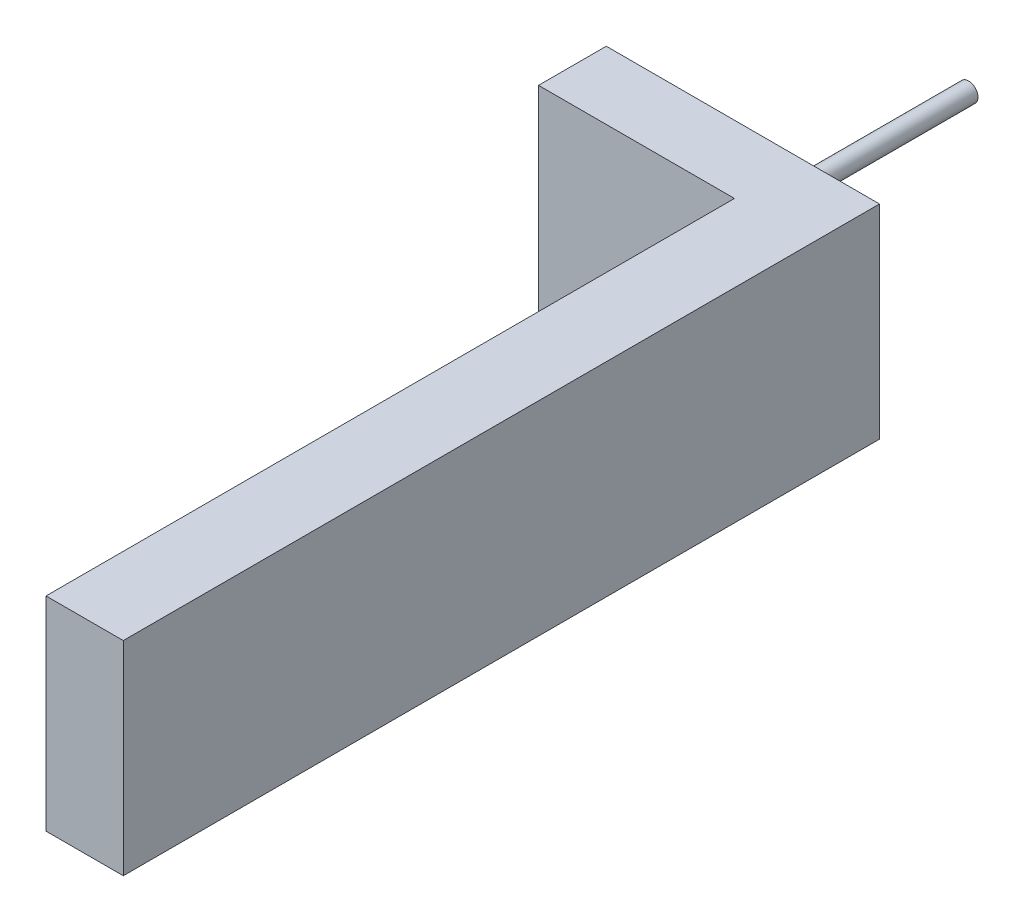
ISO-10303-21;
HEADER;
FILE_DESCRIPTION(('STEP AP214'),'2;1');
FILE_NAME('part.step','',(''),(''),'','','');
FILE_SCHEMA(('AUTOMOTIVE_DESIGN { 1 0 10303 214 1 1 1 1 }'));
ENDSEC;
DATA;
#1=APPLICATION_CONTEXT('core data for automotive mechanical design processes');
#2=APPLICATION_PROTOCOL_DEFINITION('international standard','automotive_design',2000,#1);
#3=PRODUCT_CONTEXT('',#1,'mechanical');
#4=PRODUCT('Part','Part','',(#3));
#5=PRODUCT_RELATED_PRODUCT_CATEGORY('part','',(#4));
#6=PRODUCT_DEFINITION_FORMATION('','',#4);
#7=PRODUCT_DEFINITION_CONTEXT('part definition',#1,'design');
#8=PRODUCT_DEFINITION('design','',#6,#7);
#9=PRODUCT_DEFINITION_SHAPE('','',#8);
#10=(LENGTH_UNIT() NAMED_UNIT(*) SI_UNIT(.MILLI.,.METRE.));
#11=(NAMED_UNIT(*) PLANE_ANGLE_UNIT() SI_UNIT($,.RADIAN.));
#12=(NAMED_UNIT(*) SI_UNIT($,.STERADIAN.) SOLID_ANGLE_UNIT());
#13=UNCERTAINTY_MEASURE_WITH_UNIT(LENGTH_MEASURE(1.E-05),#10,'distance_accuracy_value','');
#14=(GEOMETRIC_REPRESENTATION_CONTEXT(3) GLOBAL_UNCERTAINTY_ASSIGNED_CONTEXT((#13)) GLOBAL_UNIT_ASSIGNED_CONTEXT((#10,
#11,#12)) REPRESENTATION_CONTEXT('',''));
#15=CARTESIAN_POINT('',(0.,0.,0.));
#16=DIRECTION('',(0.,0.,1.));
#17=DIRECTION('',(1.,0.,0.));
#18=AXIS2_PLACEMENT_3D('',#15,#16,#17);
#19=CARTESIAN_POINT('',(0.,0.,353.06));
#20=DIRECTION('',(0.,0.,-1.));
#21=DIRECTION('',(-1.,0.,0.));
#22=AXIS2_PLACEMENT_3D('',#19,#20,#21);
#23=CYLINDRICAL_SURFACE('',#22,13.9);
#24=CARTESIAN_POINT('',(0.,0.,353.06));
#25=DIRECTION('',(0.,0.,1.));
#26=DIRECTION('',(1.,0.,0.));
#27=AXIS2_PLACEMENT_3D('',#24,#25,#26);
#28=CIRCLE('',#27,13.9);
#29=CARTESIAN_POINT('',(-13.9,0.,353.06));
#30=VERTEX_POINT('',#29);
#31=EDGE_CURVE('E11',#30,#30,#28,.T.);
#32=CARTESIAN_POINT('',(0.,0.,0.));
#33=DIRECTION('',(0.,0.,1.));
#34=DIRECTION('',(1.,0.,0.));
#35=AXIS2_PLACEMENT_3D('',#32,#33,#34);
#36=CIRCLE('',#35,13.9);
#37=CARTESIAN_POINT('',(-13.9,0.,0.));
#38=VERTEX_POINT('',#37);
#39=EDGE_CURVE('E46',#38,#38,#36,.T.);
#40=CARTESIAN_POINT('',(-13.9,0.,353.06));
#41=CARTESIAN_POINT('',(-13.9,0.,349.382291666667));
#42=CARTESIAN_POINT('',(-13.9,0.,345.704583333333));
#43=CARTESIAN_POINT('',(-13.9,0.,338.349166666667));
#44=CARTESIAN_POINT('',(-13.9,0.,334.671458333333));
#45=CARTESIAN_POINT('',(-13.9,0.,327.316041666667));
#46=CARTESIAN_POINT('',(-13.9,0.,323.638333333333));
#47=CARTESIAN_POINT('',(-13.9,0.,316.282916666667));
#48=CARTESIAN_POINT('',(-13.9,0.,312.605208333333));
#49=CARTESIAN_POINT('',(-13.9,0.,305.249791666667));
#50=CARTESIAN_POINT('',(-13.9,0.,301.572083333333));
#51=CARTESIAN_POINT('',(-13.9,0.,294.216666666667));
#52=CARTESIAN_POINT('',(-13.9,0.,290.538958333333));
#53=CARTESIAN_POINT('',(-13.9,0.,283.183541666667));
#54=CARTESIAN_POINT('',(-13.9,0.,279.505833333333));
#55=CARTESIAN_POINT('',(-13.9,0.,272.150416666667));
#56=CARTESIAN_POINT('',(-13.9,0.,268.472708333333));
#57=CARTESIAN_POINT('',(-13.9,0.,261.117291666667));
#58=CARTESIAN_POINT('',(-13.9,0.,257.439583333333));
#59=CARTESIAN_POINT('',(-13.9,0.,250.084166666667));
#60=CARTESIAN_POINT('',(-13.9,0.,246.406458333333));
#61=CARTESIAN_POINT('',(-13.9,0.,239.051041666667));
#62=CARTESIAN_POINT('',(-13.9,0.,235.373333333333));
#63=CARTESIAN_POINT('',(-13.9,0.,228.017916666667));
#64=CARTESIAN_POINT('',(-13.9,0.,224.340208333333));
#65=CARTESIAN_POINT('',(-13.9,0.,216.984791666667));
#66=CARTESIAN_POINT('',(-13.9,0.,213.307083333333));
#67=CARTESIAN_POINT('',(-13.9,0.,205.951666666667));
#68=CARTESIAN_POINT('',(-13.9,0.,202.273958333333));
#69=CARTESIAN_POINT('',(-13.9,0.,194.918541666667));
#70=CARTESIAN_POINT('',(-13.9,0.,191.240833333333));
#71=CARTESIAN_POINT('',(-13.9,0.,183.885416666667));
#72=CARTESIAN_POINT('',(-13.9,0.,180.207708333333));
#73=CARTESIAN_POINT('',(-13.9,0.,172.852291666667));
#74=CARTESIAN_POINT('',(-13.9,0.,169.174583333333));
#75=CARTESIAN_POINT('',(-13.9,0.,161.819166666667));
#76=CARTESIAN_POINT('',(-13.9,0.,158.141458333333));
#77=CARTESIAN_POINT('',(-13.9,0.,150.786041666667));
#78=CARTESIAN_POINT('',(-13.9,0.,147.108333333333));
#79=CARTESIAN_POINT('',(-13.9,0.,139.752916666667));
#80=CARTESIAN_POINT('',(-13.9,0.,136.075208333333));
#81=CARTESIAN_POINT('',(-13.9,0.,128.719791666667));
#82=CARTESIAN_POINT('',(-13.9,0.,125.042083333333));
#83=CARTESIAN_POINT('',(-13.9,0.,117.686666666667));
#84=CARTESIAN_POINT('',(-13.9,0.,114.008958333333));
#85=CARTESIAN_POINT('',(-13.9,0.,106.653541666667));
#86=CARTESIAN_POINT('',(-13.9,0.,102.975833333333));
#87=CARTESIAN_POINT('',(-13.9,0.,95.6204166666667));
#88=CARTESIAN_POINT('',(-13.9,0.,91.9427083333333));
#89=CARTESIAN_POINT('',(-13.9,0.,84.5872916666667));
#90=CARTESIAN_POINT('',(-13.9,0.,80.9095833333333));
#91=CARTESIAN_POINT('',(-13.9,0.,73.5541666666667));
#92=CARTESIAN_POINT('',(-13.9,0.,69.8764583333333));
#93=CARTESIAN_POINT('',(-13.9,0.,62.5210416666667));
#94=CARTESIAN_POINT('',(-13.9,0.,58.8433333333333));
#95=CARTESIAN_POINT('',(-13.9,0.,51.4879166666667));
#96=CARTESIAN_POINT('',(-13.9,0.,47.8102083333333));
#97=CARTESIAN_POINT('',(-13.9,0.,40.4547916666667));
#98=CARTESIAN_POINT('',(-13.9,0.,36.7770833333333));
#99=CARTESIAN_POINT('',(-13.9,0.,29.4216666666667));
#100=CARTESIAN_POINT('',(-13.9,0.,25.7439583333333));
#101=CARTESIAN_POINT('',(-13.9,0.,18.3885416666667));
#102=CARTESIAN_POINT('',(-13.9,0.,14.7108333333333));
#103=CARTESIAN_POINT('',(-13.9,0.,7.35541666666665));
#104=CARTESIAN_POINT('',(-13.9,0.,3.67770833333333));
#105=CARTESIAN_POINT('',(-13.9,0.,0.));
#106=B_SPLINE_CURVE_WITH_KNOTS('',3,(#40,#41,#42,#43,#44,#45,#46,#47,#48,#49,#50,#51,#52,#53,
#54,#55,#56,#57,#58,#59,#60,#61,#62,#63,#64,#65,#66,#67,#68,#69,#70,#71,#72,#73,#74,#75,#76,#77,
#78,#79,#80,#81,#82,#83,#84,#85,#86,#87,#88,#89,#90,#91,#92,#93,#94,#95,#96,#97,#98,#99,#100,
#101,#102,#103,#104,#105),.UNSPECIFIED.,.F.,.F.,(4,2,2,2,2,2,2,2,2,2,2,2,2,2,2,2,2,2,2,2,2,2,2,
2,2,2,2,2,2,2,2,2,4),(0.,11.033125,22.06625,33.099375,44.1325,55.1656249999999,66.19875,
77.2318749999999,88.2649999999999,99.298125,110.33125,121.364375,132.3975,143.430625,154.46375,
165.496875,176.53,187.563125,198.59625,209.629375,220.6625,231.695625,242.72875,253.761875,
264.795,275.828125,286.86125,297.894375,308.9275,319.960625,330.99375,342.026875,353.06),.UNSPECIFIED.);
#107=EDGE_CURVE('BSEAM43',#30,#38,#106,.T.);
#108=ORIENTED_EDGE('',*,*,#31,.F.);
#109=ORIENTED_EDGE('',*,*,#39,.T.);
#110=ORIENTED_EDGE('',*,*,#107,.T.);
#111=ORIENTED_EDGE('',*,*,#107,.F.);
#112=EDGE_LOOP('',(#108,#110,#109,#111));
#113=FACE_BOUND('',#112,.T.);
#114=ADVANCED_FACE('F43',(#113),#23,.T.);
#115=CARTESIAN_POINT('',(0.,0.,353.06));
#116=DIRECTION('',(0.,0.,1.));
#117=DIRECTION('',(1.,0.,0.));
#118=AXIS2_PLACEMENT_3D('',#115,#116,#117);
#119=PLANE('',#118);
#120=ORIENTED_EDGE('',*,*,#31,.T.);
#121=EDGE_LOOP('',(#120));
#122=FACE_BOUND('',#121,.T.);
#123=ADVANCED_FACE('F58',(#122),#119,.T.);
#124=CARTESIAN_POINT('',(0.,0.,0.));
#125=DIRECTION('',(0.,0.,1.));
#126=DIRECTION('',(1.,0.,0.));
#127=AXIS2_PLACEMENT_3D('',#124,#125,#126);
#128=PLANE('',#127);
#129=ORIENTED_EDGE('',*,*,#39,.F.);
#130=EDGE_LOOP('',(#129));
#131=FACE_BOUND('',#130,.T.);
#132=ADVANCED_FACE('F56',(#131),#128,.F.);
#133=CLOSED_SHELL('',(#114,#123,#132));
#134=MANIFOLD_SOLID_BREP('B2',#133);
#135=CARTESIAN_POINT('',(-181.647100974968,0.,453.06));
#136=DIRECTION('',(-1.,0.,0.));
#137=DIRECTION('',(0.,0.,1.));
#138=AXIS2_PLACEMENT_3D('',#135,#136,#137);
#139=PLANE('',#138);
#140=DIRECTION('',(0.,1.,0.));
#141=VECTOR('',#140,1.);
#142=CARTESIAN_POINT('',(-181.647100974968,0.,353.06));
#143=LINE('',#142,#141);
#144=CARTESIAN_POINT('',(-181.647100974968,-156.635886793434,353.06));
#145=VERTEX_POINT('',#144);
#146=CARTESIAN_POINT('',(-181.647100974968,144.003960439127,353.06));
#147=VERTEX_POINT('',#146);
#148=EDGE_CURVE('E124',#145,#147,#143,.T.);
#149=ORIENTED_EDGE('',*,*,#148,.F.);
#150=DIRECTION('',(0.,0.,-1.));
#151=VECTOR('',#150,1.);
#152=CARTESIAN_POINT('',(-181.647100974968,-156.635886793434,453.06));
#153=LINE('',#152,#151);
#154=CARTESIAN_POINT('',(-181.647100974968,-156.635886793434,453.06));
#155=VERTEX_POINT('',#154);
#156=EDGE_CURVE('E41',#155,#145,#153,.T.);
#157=ORIENTED_EDGE('',*,*,#156,.F.);
#158=DIRECTION('',(0.,1.,0.));
#159=VECTOR('',#158,1.);
#160=CARTESIAN_POINT('',(-181.647100974968,0.,453.06));
#161=LINE('',#160,#159);
#162=CARTESIAN_POINT('',(-181.647100974968,144.003960439127,453.06));
#163=VERTEX_POINT('',#162);
#164=EDGE_CURVE('E126',#155,#163,#161,.T.);
#165=ORIENTED_EDGE('',*,*,#164,.T.);
#166=DIRECTION('',(0.,0.,-1.));
#167=VECTOR('',#166,1.);
#168=CARTESIAN_POINT('',(-181.647100974968,144.003960439127,453.06));
#169=LINE('',#168,#167);
#170=EDGE_CURVE('E106',#163,#147,#169,.T.);
#171=ORIENTED_EDGE('',*,*,#170,.T.);
#172=EDGE_LOOP('',(#149,#157,#165,#171));
#173=FACE_BOUND('',#172,.T.);
#174=ADVANCED_FACE('F84',(#173),#139,.T.);
#175=CARTESIAN_POINT('',(0.,-156.635886793434,453.06));
#176=DIRECTION('',(0.,1.,0.));
#177=DIRECTION('',(0.,0.,1.));
#178=AXIS2_PLACEMENT_3D('',#175,#176,#177);
#179=PLANE('',#178);
#180=DIRECTION('',(1.,0.,0.));
#181=VECTOR('',#180,1.);
#182=CARTESIAN_POINT('',(0.,-156.635886793434,353.06));
#183=LINE('',#182,#181);
#184=CARTESIAN_POINT('',(221.563988254585,-156.635886793434,353.06));
#185=VERTEX_POINT('',#184);
#186=EDGE_CURVE('E137',#145,#185,#183,.T.);
#187=ORIENTED_EDGE('',*,*,#186,.T.);
#188=DIRECTION('',(0.,0.,-1.));
#189=VECTOR('',#188,1.);
#190=CARTESIAN_POINT('',(221.563988254585,-156.635886793434,453.06));
#191=LINE('',#190,#189);
#192=CARTESIAN_POINT('',(221.563988254585,-156.635886793434,1469.06));
#193=VERTEX_POINT('',#192);
#194=EDGE_CURVE('E91',#193,#185,#191,.T.);
#195=ORIENTED_EDGE('',*,*,#194,.F.);
#196=DIRECTION('',(1.,0.,0.));
#197=VECTOR('',#196,1.);
#198=CARTESIAN_POINT('',(221.563988254585,-156.635886793434,1469.06));
#199=LINE('',#198,#197);
#200=CARTESIAN_POINT('',(107.510541160554,-156.635886793434,1469.06));
#201=VERTEX_POINT('',#200);
#202=EDGE_CURVE('E165',#201,#193,#199,.T.);
#203=ORIENTED_EDGE('',*,*,#202,.F.);
#204=DIRECTION('',(0.,0.,-1.));
#205=VECTOR('',#204,1.);
#206=CARTESIAN_POINT('',(107.510541160554,-156.635886793434,1469.06));
#207=LINE('',#206,#205);
#208=CARTESIAN_POINT('',(107.510541160554,-156.635886793434,453.06));
#209=VERTEX_POINT('',#208);
#210=EDGE_CURVE('E175',#201,#209,#207,.T.);
#211=ORIENTED_EDGE('',*,*,#210,.T.);
#212=DIRECTION('',(1.,0.,0.));
#213=VECTOR('',#212,1.);
#214=CARTESIAN_POINT('',(0.,-156.635886793434,453.06));
#215=LINE('',#214,#213);
#216=EDGE_CURVE('E186',#155,#209,#215,.T.);
#217=ORIENTED_EDGE('',*,*,#216,.F.);
#218=ORIENTED_EDGE('',*,*,#156,.T.);
#219=EDGE_LOOP('',(#187,#195,#203,#211,#217,#218));
#220=FACE_BOUND('',#219,.T.);
#221=ADVANCED_FACE('F162',(#220),#179,.F.);
#222=CARTESIAN_POINT('',(221.563988254585,0.,453.06));
#223=DIRECTION('',(-1.,0.,0.));
#224=DIRECTION('',(0.,0.,1.));
#225=AXIS2_PLACEMENT_3D('',#222,#223,#224);
#226=PLANE('',#225);
#227=DIRECTION('',(0.,1.,0.));
#228=VECTOR('',#227,1.);
#229=CARTESIAN_POINT('',(221.563988254585,0.,353.06));
#230=LINE('',#229,#228);
#231=CARTESIAN_POINT('',(221.563988254585,144.003960439127,353.06));
#232=VERTEX_POINT('',#231);
#233=EDGE_CURVE('E145',#185,#232,#230,.T.);
#234=ORIENTED_EDGE('',*,*,#233,.T.);
#235=DIRECTION('',(0.,0.,-1.));
#236=VECTOR('',#235,1.);
#237=CARTESIAN_POINT('',(221.563988254585,144.003960439127,453.06));
#238=LINE('',#237,#236);
#239=CARTESIAN_POINT('',(221.563988254585,144.003960439127,1469.06));
#240=VERTEX_POINT('',#239);
#241=EDGE_CURVE('E127',#240,#232,#238,.T.);
#242=ORIENTED_EDGE('',*,*,#241,.F.);
#243=DIRECTION('',(0.,1.,0.));
#244=VECTOR('',#243,1.);
#245=CARTESIAN_POINT('',(221.563988254585,144.003960439127,1469.06));
#246=LINE('',#245,#244);
#247=EDGE_CURVE('E158',#193,#240,#246,.T.);
#248=ORIENTED_EDGE('',*,*,#247,.F.);
#249=ORIENTED_EDGE('',*,*,#194,.T.);
#250=EDGE_LOOP('',(#234,#242,#248,#249));
#251=FACE_BOUND('',#250,.T.);
#252=ADVANCED_FACE('F156',(#251),#226,.F.);
#253=CARTESIAN_POINT('',(0.,144.003960439127,453.06));
#254=DIRECTION('',(0.,1.,0.));
#255=DIRECTION('',(0.,0.,1.));
#256=AXIS2_PLACEMENT_3D('',#253,#254,#255);
#257=PLANE('',#256);
#258=DIRECTION('',(1.,0.,0.));
#259=VECTOR('',#258,1.);
#260=CARTESIAN_POINT('',(0.,144.003960439127,353.06));
#261=LINE('',#260,#259);
#262=EDGE_CURVE('E136',#147,#232,#261,.T.);
#263=ORIENTED_EDGE('',*,*,#262,.F.);
#264=ORIENTED_EDGE('',*,*,#170,.F.);
#265=DIRECTION('',(1.,0.,0.));
#266=VECTOR('',#265,1.);
#267=CARTESIAN_POINT('',(0.,144.003960439127,453.06));
#268=LINE('',#267,#266);
#269=CARTESIAN_POINT('',(107.510541160554,144.003960439127,453.06));
#270=VERTEX_POINT('',#269);
#271=EDGE_CURVE('E188',#163,#270,#268,.T.);
#272=ORIENTED_EDGE('',*,*,#271,.T.);
#273=DIRECTION('',(0.,0.,-1.));
#274=VECTOR('',#273,1.);
#275=CARTESIAN_POINT('',(107.510541160554,144.003960439127,1469.06));
#276=LINE('',#275,#274);
#277=CARTESIAN_POINT('',(107.510541160554,144.003960439127,1469.06));
#278=VERTEX_POINT('',#277);
#279=EDGE_CURVE('E138',#278,#270,#276,.T.);
#280=ORIENTED_EDGE('',*,*,#279,.F.);
#281=DIRECTION('',(-1.,0.,0.));
#282=VECTOR('',#281,1.);
#283=CARTESIAN_POINT('',(221.563988254585,144.003960439127,1469.06));
#284=LINE('',#283,#282);
#285=EDGE_CURVE('E178',#240,#278,#284,.T.);
#286=ORIENTED_EDGE('',*,*,#285,.F.);
#287=ORIENTED_EDGE('',*,*,#241,.T.);
#288=EDGE_LOOP('',(#263,#264,#272,#280,#286,#287));
#289=FACE_BOUND('',#288,.T.);
#290=ADVANCED_FACE('F140',(#289),#257,.T.);
#291=CARTESIAN_POINT('',(0.,0.,453.06));
#292=DIRECTION('',(0.,0.,-1.));
#293=DIRECTION('',(-1.,0.,0.));
#294=AXIS2_PLACEMENT_3D('',#291,#292,#293);
#295=CYLINDRICAL_SURFACE('',#294,13.9);
#296=CARTESIAN_POINT('',(0.,0.,453.06));
#297=DIRECTION('',(0.,0.,1.));
#298=DIRECTION('',(1.,0.,0.));
#299=AXIS2_PLACEMENT_3D('',#296,#297,#298);
#300=CIRCLE('',#299,13.9);
#301=CARTESIAN_POINT('',(13.9,0.,453.06));
#302=VERTEX_POINT('',#301);
#303=EDGE_CURVE('E128',#302,#302,#300,.T.);
#304=ORIENTED_EDGE('',*,*,#303,.T.);
#305=EDGE_LOOP('',(#304));
#306=FACE_BOUND('',#305,.T.);
#307=CARTESIAN_POINT('',(0.,0.,353.06));
#308=DIRECTION('',(0.,0.,1.));
#309=DIRECTION('',(1.,0.,0.));
#310=AXIS2_PLACEMENT_3D('',#307,#308,#309);
#311=CIRCLE('',#310,13.9);
#312=CARTESIAN_POINT('',(13.9,0.,353.06));
#313=VERTEX_POINT('',#312);
#314=EDGE_CURVE('E144',#313,#313,#311,.T.);
#315=ORIENTED_EDGE('',*,*,#314,.F.);
#316=EDGE_LOOP('',(#315));
#317=FACE_BOUND('',#316,.T.);
#318=ADVANCED_FACE('F193',(#306,#317),#295,.F.);
#319=CARTESIAN_POINT('',(0.,0.,453.06));
#320=DIRECTION('',(0.,0.,1.));
#321=DIRECTION('',(1.,0.,0.));
#322=AXIS2_PLACEMENT_3D('',#319,#320,#321);
#323=PLANE('',#322);
#324=DIRECTION('',(0.,-1.,0.));
#325=VECTOR('',#324,1.);
#326=CARTESIAN_POINT('',(107.510541160554,144.003960439127,453.06));
#327=LINE('',#326,#325);
#328=EDGE_CURVE('E98',#270,#209,#327,.T.);
#329=ORIENTED_EDGE('',*,*,#328,.F.);
#330=ORIENTED_EDGE('',*,*,#271,.F.);
#331=ORIENTED_EDGE('',*,*,#164,.F.);
#332=ORIENTED_EDGE('',*,*,#216,.T.);
#333=EDGE_LOOP('',(#329,#330,#331,#332));
#334=FACE_BOUND('',#333,.T.);
#335=ORIENTED_EDGE('',*,*,#303,.F.);
#336=EDGE_LOOP('',(#335));
#337=FACE_BOUND('',#336,.T.);
#338=ADVANCED_FACE('F196',(#334,#337),#323,.T.);
#339=CARTESIAN_POINT('',(0.,0.,353.06));
#340=DIRECTION('',(0.,0.,1.));
#341=DIRECTION('',(1.,0.,0.));
#342=AXIS2_PLACEMENT_3D('',#339,#340,#341);
#343=PLANE('',#342);
#344=ORIENTED_EDGE('',*,*,#148,.T.);
#345=ORIENTED_EDGE('',*,*,#262,.T.);
#346=ORIENTED_EDGE('',*,*,#233,.F.);
#347=ORIENTED_EDGE('',*,*,#186,.F.);
#348=EDGE_LOOP('',(#344,#345,#346,#347));
#349=FACE_BOUND('',#348,.T.);
#350=ORIENTED_EDGE('',*,*,#314,.T.);
#351=EDGE_LOOP('',(#350));
#352=FACE_BOUND('',#351,.T.);
#353=ADVANCED_FACE('F133',(#349,#352),#343,.F.);
#354=CARTESIAN_POINT('',(107.510541160554,144.003960439127,1469.06));
#355=DIRECTION('',(1.,0.,0.));
#356=DIRECTION('',(0.,0.,-1.));
#357=AXIS2_PLACEMENT_3D('',#354,#355,#356);
#358=PLANE('',#357);
#359=ORIENTED_EDGE('',*,*,#328,.T.);
#360=ORIENTED_EDGE('',*,*,#210,.F.);
#361=DIRECTION('',(0.,-1.,0.));
#362=VECTOR('',#361,1.);
#363=CARTESIAN_POINT('',(107.510541160554,144.003960439127,1469.06));
#364=LINE('',#363,#362);
#365=EDGE_CURVE('E173',#278,#201,#364,.T.);
#366=ORIENTED_EDGE('',*,*,#365,.F.);
#367=ORIENTED_EDGE('',*,*,#279,.T.);
#368=EDGE_LOOP('',(#359,#360,#366,#367));
#369=FACE_BOUND('',#368,.T.);
#370=ADVANCED_FACE('F203',(#369),#358,.F.);
#371=CARTESIAN_POINT('',(0.,0.,1469.06));
#372=DIRECTION('',(0.,0.,-1.));
#373=DIRECTION('',(-1.,0.,0.));
#374=AXIS2_PLACEMENT_3D('',#371,#372,#373);
#375=PLANE('',#374);
#376=ORIENTED_EDGE('',*,*,#247,.T.);
#377=ORIENTED_EDGE('',*,*,#285,.T.);
#378=ORIENTED_EDGE('',*,*,#365,.T.);
#379=ORIENTED_EDGE('',*,*,#202,.T.);
#380=EDGE_LOOP('',(#376,#377,#378,#379));
#381=FACE_BOUND('',#380,.T.);
#382=ADVANCED_FACE('F169',(#381),#375,.F.);
#383=CLOSED_SHELL('',(#174,#221,#252,#290,#318,#338,#353,#370,#382));
#384=MANIFOLD_SOLID_BREP('B6',#383);
#385=ADVANCED_BREP_SHAPE_REPRESENTATION('',(#18,#134,#384),#14);
#386=SHAPE_DEFINITION_REPRESENTATION(#9,#385);
ENDSEC;
END-ISO-10303-21;
